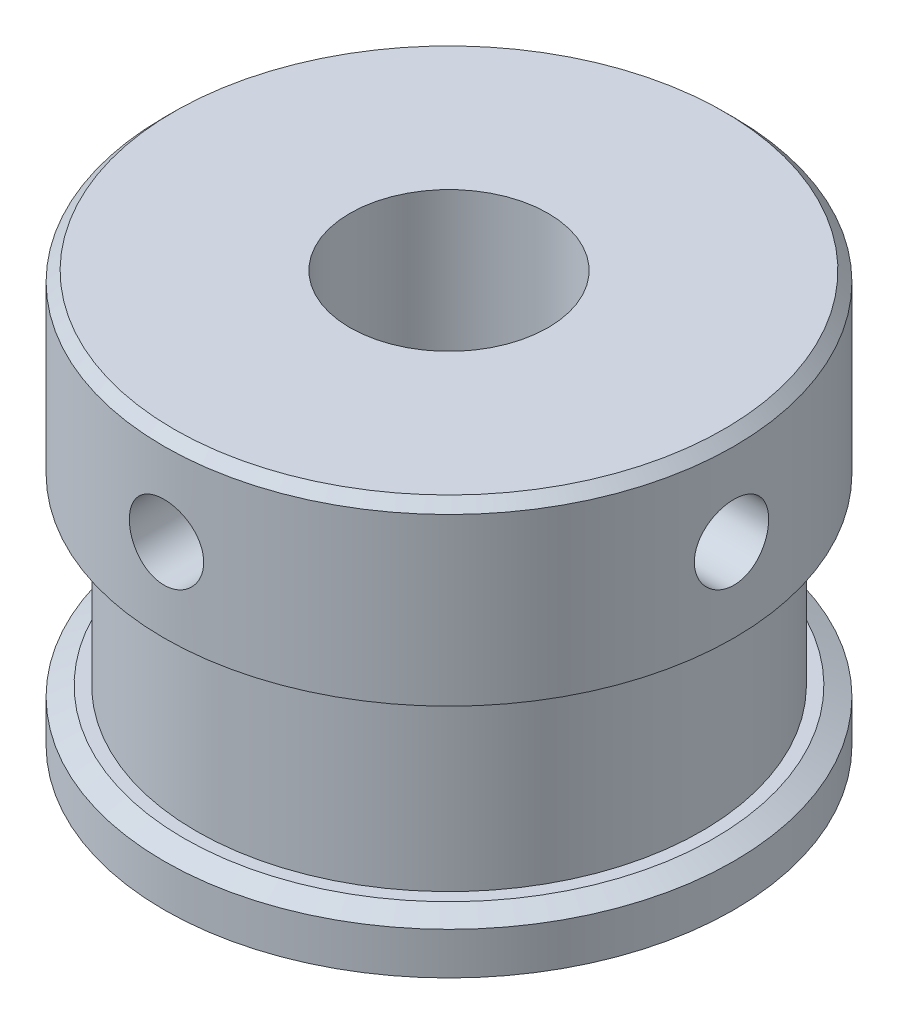
ISO-10303-21;
HEADER;
FILE_DESCRIPTION(('STEP AP214'),'2;1');
FILE_NAME('part.step','',(''),(''),'','','');
FILE_SCHEMA(('AUTOMOTIVE_DESIGN { 1 0 10303 214 1 1 1 1 }'));
ENDSEC;
DATA;
#1=APPLICATION_CONTEXT('core data for automotive mechanical design processes');
#2=APPLICATION_PROTOCOL_DEFINITION('international standard','automotive_design',2000,#1);
#3=PRODUCT_CONTEXT('',#1,'mechanical');
#4=PRODUCT('Part','Part','',(#3));
#5=PRODUCT_RELATED_PRODUCT_CATEGORY('part','',(#4));
#6=PRODUCT_DEFINITION_FORMATION('','',#4);
#7=PRODUCT_DEFINITION_CONTEXT('part definition',#1,'design');
#8=PRODUCT_DEFINITION('design','',#6,#7);
#9=PRODUCT_DEFINITION_SHAPE('','',#8);
#10=(LENGTH_UNIT() NAMED_UNIT(*) SI_UNIT(.MILLI.,.METRE.));
#11=(NAMED_UNIT(*) PLANE_ANGLE_UNIT() SI_UNIT($,.RADIAN.));
#12=(NAMED_UNIT(*) SI_UNIT($,.STERADIAN.) SOLID_ANGLE_UNIT());
#13=UNCERTAINTY_MEASURE_WITH_UNIT(LENGTH_MEASURE(1.E-05),#10,'distance_accuracy_value','');
#14=(GEOMETRIC_REPRESENTATION_CONTEXT(3) GLOBAL_UNCERTAINTY_ASSIGNED_CONTEXT((#13)) GLOBAL_UNIT_ASSIGNED_CONTEXT((#10,
#11,#12)) REPRESENTATION_CONTEXT('',''));
#15=CARTESIAN_POINT('',(0.,0.,0.));
#16=DIRECTION('',(0.,0.,1.));
#17=DIRECTION('',(1.,0.,0.));
#18=AXIS2_PLACEMENT_3D('',#15,#16,#17);
#19=CARTESIAN_POINT('',(0.,-3.15877434078088,0.));
#20=DIRECTION('',(0.,1.,0.));
#21=DIRECTION('',(0.,0.,1.));
#22=AXIS2_PLACEMENT_3D('',#19,#20,#21);
#23=CYLINDRICAL_SURFACE('',#22,4.);
#24=CARTESIAN_POINT('',(0.,3.25,3.99999999999995));
#25=CARTESIAN_POINT('',(0.081235058937846,3.24999709769688,4.00000217456146));
#26=CARTESIAN_POINT('',(0.162450241781781,3.25661976024837,3.99750379283182));
#27=CARTESIAN_POINT('',(0.322453452352335,3.28282819526992,3.9877869600693));
#28=CARTESIAN_POINT('',(0.401241827987579,3.30241210047058,3.98056918893997));
#29=CARTESIAN_POINT('',(0.554060784990846,3.35375300177175,3.96218832391547));
#30=CARTESIAN_POINT('',(0.628100224162258,3.38548651682176,3.95103284349439));
#31=CARTESIAN_POINT('',(0.769799310160252,3.46010641301579,3.92588767765355));
#32=CARTESIAN_POINT('',(0.837457239177884,3.50299578554415,3.91189723227555));
#33=CARTESIAN_POINT('',(0.967346417045847,3.60061253107091,3.88186246971226));
#34=CARTESIAN_POINT('',(1.02927073015123,3.65573026225939,3.8657600258357));
#35=CARTESIAN_POINT('',(1.14324421474367,3.77541043465882,3.8336022087132));
#36=CARTESIAN_POINT('',(1.19529036359205,3.83997575608786,3.81754685135021));
#37=CARTESIAN_POINT('',(1.28998202215988,3.9797174675232,3.7866247061772));
#38=CARTESIAN_POINT('',(1.33219393195764,4.05520436654581,3.77182648820814));
#39=CARTESIAN_POINT('',(1.40318646334089,4.21284835416851,3.74599860237434));
#40=CARTESIAN_POINT('',(1.43197244961243,4.29500276315509,3.73496742975881));
#41=CARTESIAN_POINT('',(1.47408431017553,4.46011674025819,3.71854412824134));
#42=CARTESIAN_POINT('',(1.48799593218563,4.54290503843544,3.71293924350836));
#43=CARTESIAN_POINT('',(1.50179556531653,4.70981615799384,3.70738061461212));
#44=CARTESIAN_POINT('',(1.50168936802634,4.79393841387447,3.70742453659301));
#45=CARTESIAN_POINT('',(1.48790429610022,4.95576952521296,3.71297511632051));
#46=CARTESIAN_POINT('',(1.47503808509008,5.03356090604418,3.7181546887112));
#47=CARTESIAN_POINT('',(1.43744167868336,5.18578715040532,3.73284938059527));
#48=CARTESIAN_POINT('',(1.41270969663265,5.26022150661389,3.74236515298859));
#49=CARTESIAN_POINT('',(1.35163748571911,5.40527706772825,3.76485702190249));
#50=CARTESIAN_POINT('',(1.31508648737107,5.47579948612132,3.77789517988165));
#51=CARTESIAN_POINT('',(1.23156073762701,5.60994573759098,3.80594210139317));
#52=CARTESIAN_POINT('',(1.18458238728896,5.6735671775197,3.8209515445715));
#53=CARTESIAN_POINT('',(1.07781780766547,5.79660366365088,3.85248038859105));
#54=CARTESIAN_POINT('',(1.01738298716957,5.85544864074811,3.86903347455669));
#55=CARTESIAN_POINT('',(0.887312590819074,5.96233796620582,3.90091728164086));
#56=CARTESIAN_POINT('',(0.817675603497414,6.01038065460569,3.91624781465948));
#57=CARTESIAN_POINT('',(0.66972343699248,6.09493039706252,3.94426394809077));
#58=CARTESIAN_POINT('',(0.591290713844793,6.13124758122106,3.95690498259618));
#59=CARTESIAN_POINT('',(0.428836850524664,6.18998260427004,3.97778718326958));
#60=CARTESIAN_POINT('',(0.344818210845841,6.21240661656112,3.98603030341476));
#61=CARTESIAN_POINT('',(0.178375243148726,6.24162278754195,3.99684443228049));
#62=CARTESIAN_POINT('',(0.0961036195622618,6.24918260638251,3.99969369025683));
#63=CARTESIAN_POINT('',(-0.0685724752549926,6.25069106389993,4.00025893700129));
#64=CARTESIAN_POINT('',(-0.150976912983354,6.24464272031679,3.99797606386863));
#65=CARTESIAN_POINT('',(-0.310262048561854,6.21968995769133,3.9887170977264));
#66=CARTESIAN_POINT('',(-0.387233328007332,6.2012884562629,3.98192470962303));
#67=CARTESIAN_POINT('',(-0.536941754957239,6.15281392745266,3.96451477091718));
#68=CARTESIAN_POINT('',(-0.609678350347572,6.12273938205196,3.95389672282033));
#69=CARTESIAN_POINT('',(-0.751247765110187,6.05081358756051,3.92949624407684));
#70=CARTESIAN_POINT('',(-0.819903083557801,6.00864227077657,3.91563000209349));
#71=CARTESIAN_POINT('',(-0.949392711726628,5.91408189682841,3.88626671564663));
#72=CARTESIAN_POINT('',(-1.01022412027048,5.86168906745485,3.87076907009515));
#73=CARTESIAN_POINT('',(-1.12603079874455,5.74459587787574,3.8387332949099));
#74=CARTESIAN_POINT('',(-1.18046154123566,5.67935781722729,3.82218696503731));
#75=CARTESIAN_POINT('',(-1.27771050031898,5.54034861529233,3.79078815746855));
#76=CARTESIAN_POINT('',(-1.32052767414514,5.4665767086115,3.77593583194399));
#77=CARTESIAN_POINT('',(-1.39337773518993,5.31198401322769,3.74966829822463));
#78=CARTESIAN_POINT('',(-1.42335685446911,5.23113525408955,3.73826760328496));
#79=CARTESIAN_POINT('',(-1.46907883466886,5.06499023631216,3.72054032891006));
#80=CARTESIAN_POINT('',(-1.48483050305538,4.97969676380186,3.71421061057487));
#81=CARTESIAN_POINT('',(-1.50086347097841,4.81298384045888,3.70775894792571));
#82=CARTESIAN_POINT('',(-1.50207331495834,4.73166736828311,3.70726444523344));
#83=CARTESIAN_POINT('',(-1.49136715641585,4.57005468372384,3.71158412745293));
#84=CARTESIAN_POINT('',(-1.47945239850118,4.48975837532842,3.71639780898892));
#85=CARTESIAN_POINT('',(-1.44355815630237,4.33495277328345,3.73048141585425));
#86=CARTESIAN_POINT('',(-1.41995798316518,4.26034165375467,3.73961085376662));
#87=CARTESIAN_POINT('',(-1.36169696779914,4.11609449150559,3.76121548297849));
#88=CARTESIAN_POINT('',(-1.32703332944941,4.04645971192985,3.77369151995217));
#89=CARTESIAN_POINT('',(-1.2455207593815,3.91017321030237,3.80139723903967));
#90=CARTESIAN_POINT('',(-1.19812832803005,3.84386920320011,3.81673698440968));
#91=CARTESIAN_POINT('',(-1.09334485729902,3.71985843902881,3.84806246757176));
#92=CARTESIAN_POINT('',(-1.03595064012807,3.66215442521323,3.86404840943137));
#93=CARTESIAN_POINT('',(-0.909080396784617,3.55379804417815,3.89590424609873));
#94=CARTESIAN_POINT('',(-0.839118644212971,3.50369624656535,3.91172104900642));
#95=CARTESIAN_POINT('',(-0.691213223200799,3.41597734472347,3.94054514457034));
#96=CARTESIAN_POINT('',(-0.613268934090615,3.37836121226362,3.95355221851562));
#97=CARTESIAN_POINT('',(-0.447999082002315,3.31562317095166,3.97574292606682));
#98=CARTESIAN_POINT('',(-0.360413422234205,3.29111293539811,3.98473657158358));
#99=CARTESIAN_POINT('',(-0.181875733606377,3.25830704007934,3.99686242179585));
#100=CARTESIAN_POINT('',(-0.0909254163648577,3.25000324851269,3.99999756603962));
#101=CARTESIAN_POINT('',(0.,3.25,3.99999999999995));
#102=B_SPLINE_CURVE_WITH_KNOTS('',3,(#24,#25,#26,#27,#28,#29,#30,#31,#32,#33,#34,#35,#36,#37,
#38,#39,#40,#41,#42,#43,#44,#45,#46,#47,#48,#49,#50,#51,#52,#53,#54,#55,#56,#57,#58,#59,#60,#61,
#62,#63,#64,#65,#66,#67,#68,#69,#70,#71,#72,#73,#74,#75,#76,#77,#78,#79,#80,#81,#82,#83,#84,#85,
#86,#87,#88,#89,#90,#91,#92,#93,#94,#95,#96,#97,#98,#99,#100,#101),.UNSPECIFIED.,.T.,.F.,(4,2,2,
2,2,2,2,2,2,2,2,2,2,2,2,2,2,2,2,2,2,2,2,2,2,2,2,2,2,2,2,2,2,2,2,2,2,2,4),(0.,0.243369801560539,
0.486704549530416,0.729571369213549,0.972503379609487,1.22473618582718,1.47704604925626,
1.73896674501662,2.00078269352137,2.25185874416906,2.50283106079712,2.73878345119976,
2.97477138060593,3.21522408387024,3.45575990744267,3.7124615333582,3.9692025790507,
4.22991375286077,4.49050899698847,4.73725019635931,4.98393668390529,5.2211443792385,
5.45838293254466,5.70259221859611,5.94689180019878,6.20536519455665,6.46386178920146,
6.72343066727211,6.98283874956515,7.22558763480259,7.46831350211265,7.7036314242654,
7.93900886656514,8.18672471884276,8.43451941997065,8.69572329654043,8.95694749805106,
9.22948515032046,9.5018860179613),.UNSPECIFIED.);
#103=CARTESIAN_POINT('',(0.,3.25,3.99999999999995));
#104=VERTEX_POINT('',#103);
#105=EDGE_CURVE('E68',#104,#104,#102,.T.);
#106=ORIENTED_EDGE('',*,*,#105,.T.);
#107=EDGE_LOOP('',(#106));
#108=FACE_BOUND('',#107,.T.);
#109=CARTESIAN_POINT('',(0.,8.50000000000001,0.));
#110=DIRECTION('',(0.,1.,0.));
#111=DIRECTION('',(0.,0.,1.));
#112=AXIS2_PLACEMENT_3D('',#109,#110,#111);
#113=CIRCLE('',#112,4.);
#114=CARTESIAN_POINT('',(0.,8.50000000000001,4.));
#115=VERTEX_POINT('',#114);
#116=EDGE_CURVE('E146',#115,#115,#113,.T.);
#117=ORIENTED_EDGE('',*,*,#116,.T.);
#118=EDGE_LOOP('',(#117));
#119=FACE_BOUND('',#118,.T.);
#120=CARTESIAN_POINT('',(0.,-8.50000000000001,0.));
#121=DIRECTION('',(0.,1.,0.));
#122=DIRECTION('',(0.,0.,1.));
#123=AXIS2_PLACEMENT_3D('',#120,#121,#122);
#124=CIRCLE('',#123,4.);
#125=CARTESIAN_POINT('',(0.,-8.50000000000001,4.));
#126=VERTEX_POINT('',#125);
#127=EDGE_CURVE('E149',#126,#126,#124,.T.);
#128=ORIENTED_EDGE('',*,*,#127,.F.);
#129=EDGE_LOOP('',(#128));
#130=FACE_BOUND('',#129,.T.);
#131=CARTESIAN_POINT('',(3.70809924354781,4.75,-1.50000000000006));
#132=CARTESIAN_POINT('',(3.70809640633804,4.8310074837208,-1.50000304106115));
#133=CARTESIAN_POINT('',(3.71078260240982,4.91199492250365,-1.49341597549494));
#134=CARTESIAN_POINT('',(3.72116159304967,5.0715280829132,-1.46736187895472));
#135=CARTESIAN_POINT('',(3.72885423767118,5.15007387759499,-1.44789523373263));
#136=CARTESIAN_POINT('',(3.74825480280906,5.30237537161352,-1.39689657610573));
#137=CARTESIAN_POINT('',(3.7599530956926,5.37614205665111,-1.36539347266352));
#138=CARTESIAN_POINT('',(3.78603134206595,5.51737189681887,-1.29131856742703));
#139=CARTESIAN_POINT('',(3.80041210067322,5.58483315028252,-1.24874344095041));
#140=CARTESIAN_POINT('',(3.83103574665713,5.71489031162281,-1.15146661374164));
#141=CARTESIAN_POINT('',(3.84733341923602,5.77712852962941,-1.0963038121331));
#142=CARTESIAN_POINT('',(3.87949750628546,5.8917228146715,-0.976395839778976));
#143=CARTESIAN_POINT('',(3.89536382814787,5.94407677374185,-0.911648630256719));
#144=CARTESIAN_POINT('',(3.92552873936557,6.0391395122956,-0.771694655177635));
#145=CARTESIAN_POINT('',(3.93975561223508,6.08145947471586,-0.696206947538071));
#146=CARTESIAN_POINT('',(3.96438007973844,6.15265117252493,-0.538555771965293));
#147=CARTESIAN_POINT('',(3.97477900216999,6.18152757199199,-0.456394630933576));
#148=CARTESIAN_POINT('',(3.99018697103433,6.22375789577463,-0.291489341676866));
#149=CARTESIAN_POINT('',(3.99540915214772,6.23772762744046,-0.208923197281629));
#150=CARTESIAN_POINT('',(4.00064014107942,6.25172120094499,-0.0424643637948101));
#151=CARTESIAN_POINT('',(4.00065064414904,6.25174957761871,0.0414278850628154));
#152=CARTESIAN_POINT('',(3.99559265903895,6.23821823853482,0.203743543064466));
#153=CARTESIAN_POINT('',(3.99077541996683,6.22533070205117,0.282232178266892));
#154=CARTESIAN_POINT('',(3.97693274932262,6.18746408477444,0.435839217984403));
#155=CARTESIAN_POINT('',(3.96790701975577,6.16248414773798,0.510957383430328));
#156=CARTESIAN_POINT('',(3.9463776916753,6.10082954832416,0.656989017303131));
#157=CARTESIAN_POINT('',(3.93382539470077,6.06398999473155,0.727825392287315));
#158=CARTESIAN_POINT('',(3.90651310225278,5.97980790307058,0.862486607957574));
#159=CARTESIAN_POINT('',(3.89175239512838,5.93246197698241,0.926309176932366));
#160=CARTESIAN_POINT('',(3.86052529655814,5.82537271371684,1.04909048680097));
#161=CARTESIAN_POINT('',(3.84400963763883,5.76506608434956,1.10754614526347));
#162=CARTESIAN_POINT('',(3.81182460645724,5.63540700667841,1.21370395569337));
#163=CARTESIAN_POINT('',(3.79615544748848,5.56605229341335,1.26140340692894));
#164=CARTESIAN_POINT('',(3.76712703500335,5.41828053253717,1.34565611808146));
#165=CARTESIAN_POINT('',(3.75382677150278,5.33969650631392,1.38193847851824));
#166=CARTESIAN_POINT('',(3.73172438629005,5.17690377483242,1.44056464441497));
#167=CARTESIAN_POINT('',(3.72291976205787,5.09269822840631,1.46291620605594));
#168=CARTESIAN_POINT('',(3.71139597222853,4.92602403768405,1.49190191709666));
#169=CARTESIAN_POINT('',(3.7083678524154,4.84371589446387,1.4993352115896));
#170=CARTESIAN_POINT('',(3.70786539525017,4.67899064325826,1.50057885636267));
#171=CARTESIAN_POINT('',(3.71038967003986,4.59657356764753,1.49439261093762));
#172=CARTESIAN_POINT('',(3.72039381629735,4.43807007771233,1.46929733520157));
#173=CARTESIAN_POINT('',(3.72763276216451,4.36186886423538,1.45100618334219));
#174=CARTESIAN_POINT('',(3.74596487046363,4.21365205527983,1.40299774640634));
#175=CARTESIAN_POINT('',(3.75705882250172,4.14163732083186,1.37327812034626));
#176=CARTESIAN_POINT('',(3.7823624311608,4.0008355619238,1.30200292275282));
#177=CARTESIAN_POINT('',(3.79667328892068,3.93227070786271,1.26004545177045));
#178=CARTESIAN_POINT('',(3.8266281429429,3.802871018274,1.16591317862475));
#179=CARTESIAN_POINT('',(3.8422726259407,3.74203902537537,1.11373463696434));
#180=CARTESIAN_POINT('',(3.87433046553175,3.62583162680488,0.996727340900945));
#181=CARTESIAN_POINT('',(3.89072969357024,3.57104659123125,0.931306341491033));
#182=CARTESIAN_POINT('',(3.92149874963308,3.47316163241058,0.791797471753086));
#183=CARTESIAN_POINT('',(3.93586857107675,3.43006174705417,0.717709573322608));
#184=CARTESIAN_POINT('',(3.96094985704561,3.35705394380039,0.563016329468408));
#185=CARTESIAN_POINT('',(3.97167381338012,3.3271008762074,0.482434433064558));
#186=CARTESIAN_POINT('',(3.9882943671257,3.28134358615008,0.3168818875232));
#187=CARTESIAN_POINT('',(3.99419323299415,3.2655327145776,0.231913320723552));
#188=CARTESIAN_POINT('',(4.00028407317076,3.24922559724517,0.0653355852737941));
#189=CARTESIAN_POINT('',(4.00078860953765,3.247890516941,-0.0161807680608607));
#190=CARTESIAN_POINT('',(3.99684889809223,3.2584151594454,-0.178226786412423));
#191=CARTESIAN_POINT('',(3.99240524713131,3.27027329088588,-0.258756569245246));
#192=CARTESIAN_POINT('',(3.97921089603773,3.30625885149363,-0.414548248377117));
#193=CARTESIAN_POINT('',(3.97056791378018,3.33007990587834,-0.489890731068837));
#194=CARTESIAN_POINT('',(3.94987783620989,3.38901001338434,-0.63551547300639));
#195=CARTESIAN_POINT('',(3.93783009655661,3.42412120330476,-0.70579677127553));
#196=CARTESIAN_POINT('',(3.91090618300071,3.5063139435048,-0.842540176994407));
#197=CARTESIAN_POINT('',(3.89593240108828,3.55383664051411,-0.908717548846866));
#198=CARTESIAN_POINT('',(3.86499507694845,3.65880783018757,-1.03241734752336));
#199=CARTESIAN_POINT('',(3.84903118274027,3.71625986580787,-1.08993667125585));
#200=CARTESIAN_POINT('',(3.81688129739174,3.84306413164506,-1.19781214236192));
#201=CARTESIAN_POINT('',(3.80072805349159,3.91288440215428,-1.24762999816027));
#202=CARTESIAN_POINT('',(3.77098325003637,4.06041586957329,-1.33484709556848));
#203=CARTESIAN_POINT('',(3.75739195631214,4.13812788405347,-1.37224504878159));
#204=CARTESIAN_POINT('',(3.73402269853263,4.30295568097541,-1.43465886974262));
#205=CARTESIAN_POINT('',(3.72443803290857,4.39033436651178,-1.45906002899527));
#206=CARTESIAN_POINT('',(3.71147994336314,4.56848527195578,-1.49172356722085));
#207=CARTESIAN_POINT('',(3.70810242179735,4.65925521270999,-1.49999659339576));
#208=CARTESIAN_POINT('',(3.70809924354781,4.75,-1.50000000000006));
#209=B_SPLINE_CURVE_WITH_KNOTS('',3,(#131,#132,#133,#134,#135,#136,#137,#138,#139,#140,#141,
#142,#143,#144,#145,#146,#147,#148,#149,#150,#151,#152,#153,#154,#155,#156,#157,#158,#159,#160,
#161,#162,#163,#164,#165,#166,#167,#168,#169,#170,#171,#172,#173,#174,#175,#176,#177,#178,#179,
#180,#181,#182,#183,#184,#185,#186,#187,#188,#189,#190,#191,#192,#193,#194,#195,#196,#197,#198,
#199,#200,#201,#202,#203,#204,#205,#206,#207,#208),.UNSPECIFIED.,.T.,.F.,(4,2,2,2,2,2,2,2,2,2,2,
2,2,2,2,2,2,2,2,2,2,2,2,2,2,2,2,2,2,2,2,2,2,2,2,2,2,2,4),(0.,0.242684541416169,
0.485361814598863,0.72745985675704,0.969630679682935,1.22274652401127,1.47591628822982,
1.7377007213642,1.99939426381329,2.24980018489679,2.50012465404859,2.73806472803198,
2.97602165263341,3.21744131210674,3.45893893628982,3.71456675065877,3.97025867827335,
4.23162592252967,4.49284751635475,4.73965657740485,4.98640395388883,5.22143845928197,
5.45652113429523,5.70041561005818,5.94439948466352,6.20385016993625,6.46330169650184,
6.72185508890172,6.98028685560127,7.22365720549934,7.46699820319476,7.70440274003887,
7.94185223512828,8.18928323676982,8.43680270894959,8.69738599542076,8.95799630544242,
9.23003178870926,9.50188762323054),.UNSPECIFIED.);
#210=CARTESIAN_POINT('',(3.70809924354781,4.75,-1.50000000000006));
#211=VERTEX_POINT('',#210);
#212=EDGE_CURVE('E77',#211,#211,#209,.T.);
#213=ORIENTED_EDGE('',*,*,#212,.T.);
#214=EDGE_LOOP('',(#213));
#215=FACE_BOUND('',#214,.T.);
#216=ADVANCED_FACE('F17',(#108,#119,#130,#215),#23,.F.);
#217=CARTESIAN_POINT('',(0.,-3.15877434078088,0.));
#218=DIRECTION('',(0.,1.,0.));
#219=DIRECTION('',(0.,0.,1.));
#220=AXIS2_PLACEMENT_3D('',#217,#218,#219);
#221=CYLINDRICAL_SURFACE('',#220,11.5);
#222=CARTESIAN_POINT('',(0.,8.1,0.));
#223=DIRECTION('',(0.,1.,0.));
#224=DIRECTION('',(0.,0.,1.));
#225=AXIS2_PLACEMENT_3D('',#222,#223,#224);
#226=CIRCLE('',#225,11.5);
#227=CARTESIAN_POINT('',(0.,8.1,11.5));
#228=VERTEX_POINT('',#227);
#229=EDGE_CURVE('E38',#228,#228,#226,.F.);
#230=ORIENTED_EDGE('',*,*,#229,.T.);
#231=EDGE_LOOP('',(#230));
#232=FACE_BOUND('',#231,.T.);
#233=CARTESIAN_POINT('',(0.,1.40000000000001,0.));
#234=DIRECTION('',(0.,-1.,0.));
#235=DIRECTION('',(0.,0.,-1.));
#236=AXIS2_PLACEMENT_3D('',#233,#234,#235);
#237=CIRCLE('',#236,11.5);
#238=CARTESIAN_POINT('',(0.,1.40000000000001,-11.5));
#239=VERTEX_POINT('',#238);
#240=EDGE_CURVE('E156',#239,#239,#237,.F.);
#241=ORIENTED_EDGE('',*,*,#240,.T.);
#242=EDGE_LOOP('',(#241));
#243=FACE_BOUND('',#242,.T.);
#244=CARTESIAN_POINT('',(0.,3.25,11.4999999999999));
#245=CARTESIAN_POINT('',(-0.08387367547568,3.25000354399216,11.4999987889705));
#246=CARTESIAN_POINT('',(-0.16779900786446,3.25705851900221,11.4990727424737));
#247=CARTESIAN_POINT('',(-0.33331219705856,3.28508962832947,11.4954676443032));
#248=CARTESIAN_POINT('',(-0.414897556062015,3.30608010041326,11.4927867872035));
#249=CARTESIAN_POINT('',(-0.573310862574349,3.36135143122372,11.4859739305167));
#250=CARTESIAN_POINT('',(-0.650142050157395,3.39562312019121,11.4818429323363));
#251=CARTESIAN_POINT('',(-0.796948541825167,3.47646348354351,11.4725886401554));
#252=CARTESIAN_POINT('',(-0.866924973730797,3.52303013034988,11.4674655098059));
#253=CARTESIAN_POINT('',(-0.99846758428207,3.6274357031806,11.4567642658025));
#254=CARTESIAN_POINT('',(-1.05998690599804,3.68533343735684,11.4511838707794));
#255=CARTESIAN_POINT('',(-1.1724652872007,3.81063133213307,11.4402153265713));
#256=CARTESIAN_POINT('',(-1.22342379516471,3.87803198870025,11.4348271874387));
#257=CARTESIAN_POINT('',(-1.31351024770354,4.02072919284479,11.4248308534604));
#258=CARTESIAN_POINT('',(-1.3525939860959,4.09605387217164,11.4202256004087));
#259=CARTESIAN_POINT('',(-1.41753910895751,4.25226794545656,11.4123468049196));
#260=CARTESIAN_POINT('',(-1.44340103860289,4.33315710981761,11.4090732075751));
#261=CARTESIAN_POINT('',(-1.48102535604964,4.49771622469038,11.4042503168757));
#262=CARTESIAN_POINT('',(-1.49286711031839,4.58136773971688,11.4026913209814));
#263=CARTESIAN_POINT('',(-1.50236057802508,4.74948411506376,11.4014445124782));
#264=CARTESIAN_POINT('',(-1.50001291115999,4.83394893970348,11.4017566181523));
#265=CARTESIAN_POINT('',(-1.48125926874543,5.00073965657812,11.4042078698221));
#266=CARTESIAN_POINT('',(-1.46494091291049,5.08307559181957,11.4063356283479));
#267=CARTESIAN_POINT('',(-1.41884591021781,5.24383042386289,11.4121606755201));
#268=CARTESIAN_POINT('',(-1.38906896860542,5.32224923483458,11.4158579985412));
#269=CARTESIAN_POINT('',(-1.31680849453618,5.47321485926694,11.4244184254902));
#270=CARTESIAN_POINT('',(-1.27428708175244,5.5457433365129,11.4292849960909));
#271=CARTESIAN_POINT('',(-1.17777176527455,5.68266848096278,11.4396329366713));
#272=CARTESIAN_POINT('',(-1.12377729049829,5.74706474312381,11.4451143372484));
#273=CARTESIAN_POINT('',(-1.00536389947357,5.86640590602695,11.4561248839528));
#274=CARTESIAN_POINT('',(-0.940869497437052,5.92127593108799,11.4616540786179));
#275=CARTESIAN_POINT('',(-0.803546382709047,6.01942340252411,11.4720986286902));
#276=CARTESIAN_POINT('',(-0.730717647775637,6.06270081796084,11.4770139824593));
#277=CARTESIAN_POINT('',(-0.578734018158932,6.13643540224874,11.485680465931));
#278=CARTESIAN_POINT('',(-0.499576715280729,6.16688766288078,11.4894311497676));
#279=CARTESIAN_POINT('',(-0.337212307082038,6.214046930639,11.4953417256299));
#280=CARTESIAN_POINT('',(-0.254005408543423,6.23075463881603,11.4975016987902));
#281=CARTESIAN_POINT('',(-0.0865509170951626,6.24985297755591,11.4999768972912));
#282=CARTESIAN_POINT('',(-0.00231527186087731,6.2523467107699,11.5003054069739));
#283=CARTESIAN_POINT('',(0.165372777140066,6.24321871999352,11.4991165911979));
#284=CARTESIAN_POINT('',(0.24882519905947,6.23159732396733,11.4975993086261));
#285=CARTESIAN_POINT('',(0.41227203547529,6.19465463600026,11.492897652094));
#286=CARTESIAN_POINT('',(0.49227779807655,6.16938272179503,11.4897192880655));
#287=CARTESIAN_POINT('',(0.64691586058682,6.10590785904704,11.48205116634));
#288=CARTESIAN_POINT('',(0.721547963291835,6.06770443623338,11.4775613605459));
#289=CARTESIAN_POINT('',(0.863779209036563,5.97920309552064,11.4677374606315));
#290=CARTESIAN_POINT('',(0.931336693285117,5.92883874473719,11.4623987859822));
#291=CARTESIAN_POINT('',(1.05707662855495,5.81753888637903,11.4514881052812));
#292=CARTESIAN_POINT('',(1.11525867281435,5.75660292038336,11.445916089119));
#293=CARTESIAN_POINT('',(1.22096386356528,5.6254344134895,11.435125505803));
#294=CARTESIAN_POINT('',(1.26841850564589,5.55514643909561,11.4299093510067));
#295=CARTESIAN_POINT('',(1.35084798726365,5.4075370670475,11.4204613909882));
#296=CARTESIAN_POINT('',(1.38582309548539,5.33021582086473,11.4162295645741));
#297=CARTESIAN_POINT('',(1.44219073788253,5.1709524053382,11.4092460653583));
#298=CARTESIAN_POINT('',(1.46362137263966,5.0890239105499,11.4064902439233));
#299=CARTESIAN_POINT('',(1.4924141614814,4.92269273085985,11.4027590627917));
#300=CARTESIAN_POINT('',(1.49977703312957,4.83829017237725,11.4017836122825));
#301=CARTESIAN_POINT('',(1.50021133318704,4.67008850104972,11.4017264204223));
#302=CARTESIAN_POINT('',(1.49339039767644,4.58628965071035,11.4026304165807));
#303=CARTESIAN_POINT('',(1.46587918768885,4.42104056014687,11.4061995300276));
#304=CARTESIAN_POINT('',(1.44518891595677,4.33959031945794,11.4088646469677));
#305=CARTESIAN_POINT('',(1.39056092558017,4.18136788518609,11.4156511823152));
#306=CARTESIAN_POINT('',(1.35662887172568,4.10459370741385,11.4197719779168));
#307=CARTESIAN_POINT('',(1.2764911013054,3.95781135393135,11.4290065281123));
#308=CARTESIAN_POINT('',(1.23028517717279,3.88780329267208,11.4341202994983));
#309=CARTESIAN_POINT('',(1.12651352497628,3.75599083285157,11.444811054693));
#310=CARTESIAN_POINT('',(1.06886765466833,3.69424977382769,11.4503911357269));
#311=CARTESIAN_POINT('',(0.944020432211569,3.58127690655438,11.4613587220616));
#312=CARTESIAN_POINT('',(0.876816837734342,3.5300475713594,11.4667461817993));
#313=CARTESIAN_POINT('',(0.734440983208721,3.43936981300331,11.4767463223463));
#314=CARTESIAN_POINT('',(0.659236923265528,3.39997097741546,11.4813557074918));
#315=CARTESIAN_POINT('',(0.503260285581684,3.33441873478555,11.4892472513977));
#316=CARTESIAN_POINT('',(0.422493808644726,3.30825107073331,11.4925308379762));
#317=CARTESIAN_POINT('',(0.28443348518241,3.27610206984066,11.4966176944656));
#318=CARTESIAN_POINT('',(0.228006817894454,3.26632803844138,11.4978798128957));
#319=CARTESIAN_POINT('',(0.114394773946369,3.25327582179696,11.4995713752256));
#320=CARTESIAN_POINT('',(0.0572094035826113,3.24999758267804,11.5000008260311));
#321=CARTESIAN_POINT('',(0.,3.25,11.4999999999999));
#322=B_SPLINE_CURVE_WITH_KNOTS('',3,(#244,#245,#246,#247,#248,#249,#250,#251,#252,#253,#254,
#255,#256,#257,#258,#259,#260,#261,#262,#263,#264,#265,#266,#267,#268,#269,#270,#271,#272,#273,
#274,#275,#276,#277,#278,#279,#280,#281,#282,#283,#284,#285,#286,#287,#288,#289,#290,#291,#292,
#293,#294,#295,#296,#297,#298,#299,#300,#301,#302,#303,#304,#305,#306,#307,#308,#309,#310,#311,
#312,#313,#314,#315,#316,#317,#318,#319,#320,#321),.UNSPECIFIED.,.T.,.F.,(4,2,2,2,2,2,2,2,2,2,2,
2,2,2,2,2,2,2,2,2,2,2,2,2,2,2,2,2,2,2,2,2,2,2,2,2,2,2,4),(0.,0.251412042547973,
0.503083156235488,0.754580817165497,1.00603702914679,1.25883466510266,1.51164549971169,
1.76538625583096,2.01911654858883,2.27140353166937,2.52367949665773,2.77438476136931,
3.02509551700846,3.27655897620068,3.5280349551488,3.78140588995846,4.03477750095762,
4.28824598999318,4.5417015498833,4.79331627883386,5.04492516164317,5.29562994105653,
5.54634391621596,5.79845977877208,6.05058657665799,6.30428060859517,6.55796917816599,
6.81094090821314,7.06389973442208,7.31494594958275,7.56599211505818,7.81693100134909,
8.0678741316072,8.32064158523565,8.57346843851722,8.82734068052484,9.08093878097975,
9.25242586815105,9.42391153306391),.UNSPECIFIED.);
#323=CARTESIAN_POINT('',(0.,3.25,11.4999999999999));
#324=VERTEX_POINT('',#323);
#325=EDGE_CURVE('E30',#324,#324,#322,.T.);
#326=ORIENTED_EDGE('',*,*,#325,.T.);
#327=EDGE_LOOP('',(#326));
#328=FACE_BOUND('',#327,.T.);
#329=CARTESIAN_POINT('',(11.4017542509914,4.75,-1.50000000000006));
#330=CARTESIAN_POINT('',(11.4017555010927,4.66612974605352,-1.49999645301455));
#331=CARTESIAN_POINT('',(11.4026896606142,4.58220782531928,-1.49294203416227));
#332=CARTESIAN_POINT('',(11.4063237260242,4.41670172381517,-1.46491333453703));
#333=CARTESIAN_POINT('',(11.4090254521656,4.33512004354481,-1.44392470388231));
#334=CARTESIAN_POINT('',(11.4158835494573,4.17671451862599,-1.38865875899913));
#335=CARTESIAN_POINT('',(11.4200389070908,4.09988740275981,-1.35439070180734));
#336=CARTESIAN_POINT('',(11.4293348464697,3.95308774393182,-1.27355889313984));
#337=CARTESIAN_POINT('',(11.4344752664174,3.88311407813168,-1.22699716043969));
#338=CARTESIAN_POINT('',(11.445197137233,3.75156838698373,-1.1225965695889));
#339=CARTESIAN_POINT('',(11.450780832969,3.69004408459843,-1.06469780379545));
#340=CARTESIAN_POINT('',(11.4617399588797,3.57755607833823,-0.939395748791601));
#341=CARTESIAN_POINT('',(11.4671153784681,3.52659291069306,-0.871991977267075));
#342=CARTESIAN_POINT('',(11.4770753814867,3.43650155148105,-0.729292001348455));
#343=CARTESIAN_POINT('',(11.4816570418954,3.3974167196513,-0.653968201092628));
#344=CARTESIAN_POINT('',(11.4894885821545,3.3324693333558,-0.497756037054366));
#345=CARTESIAN_POINT('',(11.4927385156426,3.30660624635004,-0.41686789753902));
#346=CARTESIAN_POINT('',(11.4975246059022,3.26897956068909,-0.252312093764315));
#347=CARTESIAN_POINT('',(11.4990704204953,3.25713647735638,-0.168662889559703));
#348=CARTESIAN_POINT('',(11.5003071067839,3.24763955068957,-0.000551051593681437));
#349=CARTESIAN_POINT('',(11.4999980575609,3.24998510242647,0.0839115473355527));
#350=CARTESIAN_POINT('',(11.4975676318305,3.26873536177966,0.250711499958782));
#351=CARTESIAN_POINT('',(11.495457275758,3.28505458012217,0.333058646852817));
#352=CARTESIAN_POINT('',(11.4896737037343,3.3311551807269,0.493835455554753));
#353=CARTESIAN_POINT('',(11.4860004558634,3.36093683793923,0.572265037315937));
#354=CARTESIAN_POINT('',(11.4774848372199,3.43320714577403,0.723243851165286));
#355=CARTESIAN_POINT('',(11.4726390893117,3.47573258809547,0.795775273641111));
#356=CARTESIAN_POINT('',(11.4623201935655,3.57225654245435,0.932704606534559));
#357=CARTESIAN_POINT('',(11.4568470144162,3.62625562718919,0.997102110698442));
#358=CARTESIAN_POINT('',(11.4458372756447,3.74467233134335,1.11643819513597));
#359=CARTESIAN_POINT('',(11.4403005474488,3.80916448462651,1.17130282662096));
#360=CARTESIAN_POINT('',(11.4298278324284,3.9464811631493,1.26944048103685));
#361=CARTESIAN_POINT('',(11.4248918478016,4.0193057188702,1.31271346156173));
#362=CARTESIAN_POINT('',(11.4161795912172,4.17128812702737,1.38644483776155));
#363=CARTESIAN_POINT('',(11.4124038861902,4.25044905177648,1.41689697165309));
#364=CARTESIAN_POINT('',(11.4064505206359,4.41282134575288,1.46405488015556));
#365=CARTESIAN_POINT('',(11.4042727759921,4.49603250153029,1.48076137834171));
#366=CARTESIAN_POINT('',(11.4017774109739,4.66348911375157,1.49985514370491));
#367=CARTESIAN_POINT('',(11.4014462521966,4.7477224923938,1.50234663257978));
#368=CARTESIAN_POINT('',(11.4026457215703,4.91540547241167,1.49321496203155));
#369=CARTESIAN_POINT('',(11.4041763064158,4.99885509197255,1.48159213091644));
#370=CARTESIAN_POINT('',(11.4089144348313,5.16228727005644,1.44464963434862));
#371=CARTESIAN_POINT('',(11.4121157621508,5.24228149832656,1.41938072914776));
#372=CARTESIAN_POINT('',(11.4198296111094,5.39689781992072,1.35591573806601));
#373=CARTESIAN_POINT('',(11.4243421826685,5.47151970858117,1.31771916001075));
#374=CARTESIAN_POINT('',(11.4342023912125,5.61374376689707,1.2292280211062));
#375=CARTESIAN_POINT('',(11.4395546717525,5.68130319523188,1.17886529183306));
#376=CARTESIAN_POINT('',(11.4504767766229,5.80704780596861,1.06756750174705));
#377=CARTESIAN_POINT('',(11.4560466101759,5.86523259042252,1.00663199235392));
#378=CARTESIAN_POINT('',(11.4668179794224,5.97094402888093,0.875462338341581));
#379=CARTESIAN_POINT('',(11.4720170065382,6.01840207901288,0.805172669271225));
#380=CARTESIAN_POINT('',(11.4814231748458,6.10083753540954,0.657558967858969));
#381=CARTESIAN_POINT('',(11.4856303375335,6.13581521216148,0.580235088015154));
#382=CARTESIAN_POINT('',(11.4925676402684,6.19218448448027,0.420973071168353));
#383=CARTESIAN_POINT('',(11.4953020399787,6.21361529312715,0.339049006517422));
#384=CARTESIAN_POINT('',(11.4990034533124,6.24240992971606,0.172727196515954));
#385=CARTESIAN_POINT('',(11.4999705540812,6.24977445126497,0.088329573344667));
#386=CARTESIAN_POINT('',(11.5000279000697,6.25021369871506,-0.0798746769517216));
#387=CARTESIAN_POINT('',(11.4991320170928,6.24339404014946,-0.163681043071324));
#388=CARTESIAN_POINT('',(11.49559170592,6.21588274606022,-0.328945491538674));
#389=CARTESIAN_POINT('',(11.4929472797203,6.19519112637327,-0.410403576567188));
#390=CARTESIAN_POINT('',(11.4862056490748,6.14055733378626,-0.568642219855355));
#391=CARTESIAN_POINT('',(11.4821090502512,6.10662068407238,-0.645424712431759));
#392=CARTESIAN_POINT('',(11.4729159452671,6.02647113767378,-0.79222178732868));
#393=CARTESIAN_POINT('',(11.4678194229654,5.9802580428133,-0.862236260369767));
#394=CARTESIAN_POINT('',(11.4571496362498,5.87647834381004,-0.99404872854614));
#395=CARTESIAN_POINT('',(11.4515732358813,5.8188332476528,-1.05578467493504));
#396=CARTESIAN_POINT('',(11.4405969587125,5.69398969875131,-1.168747587459));
#397=CARTESIAN_POINT('',(11.4351971239349,5.62678899182307,-1.21997206693612));
#398=CARTESIAN_POINT('',(11.4251611483061,5.48441564651668,-1.3106444109052));
#399=CARTESIAN_POINT('',(11.4205283132887,5.40921068337356,-1.35004186374937));
#400=CARTESIAN_POINT('',(11.4125895944072,5.25323216464592,-1.41559127347491));
#401=CARTESIAN_POINT('',(11.4092822814234,5.17246471702341,-1.44175750369105));
#402=CARTESIAN_POINT('',(11.4051643222105,5.03440820135863,-1.47390259785783));
#403=CARTESIAN_POINT('',(11.4038919959272,4.97798658642477,-1.4836748717358));
#404=CARTESIAN_POINT('',(11.4021865375875,4.86438465517099,-1.49672475464488));
#405=CARTESIAN_POINT('',(11.4017533983503,4.80720434534723,-1.50000241924853));
#406=CARTESIAN_POINT('',(11.4017542509914,4.75,-1.50000000000006));
#407=B_SPLINE_CURVE_WITH_KNOTS('',3,(#329,#330,#331,#332,#333,#334,#335,#336,#337,#338,#339,
#340,#341,#342,#343,#344,#345,#346,#347,#348,#349,#350,#351,#352,#353,#354,#355,#356,#357,#358,
#359,#360,#361,#362,#363,#364,#365,#366,#367,#368,#369,#370,#371,#372,#373,#374,#375,#376,#377,
#378,#379,#380,#381,#382,#383,#384,#385,#386,#387,#388,#389,#390,#391,#392,#393,#394,#395,#396,
#397,#398,#399,#400,#401,#402,#403,#404,#405,#406),.UNSPECIFIED.,.T.,.F.,(4,2,2,2,2,2,2,2,2,2,2,
2,2,2,2,2,2,2,2,2,2,2,2,2,2,2,2,2,2,2,2,2,2,2,2,2,2,2,4),(0.,0.251401763409768,
0.503062830563611,0.754548780434053,1.00599345881713,1.25880454908435,1.51162847240701,
1.76536449581034,2.01909029853272,2.27137063822617,2.52364022208437,2.77437738752203,
3.02511967412113,3.27659295200129,3.52807878491239,3.78143590806989,4.03479395807764,
4.28827560662903,4.54174391096107,4.79335142269097,5.04495308198347,5.29562522352576,
5.54630690957678,5.79842717499935,6.05055813995757,6.30425867142354,6.55795370410214,
6.81091098132409,7.06385578493153,7.31492390374275,7.56599173592654,7.81695498432961,
8.06792228421943,8.32067641903956,8.57349027819169,8.82736691371988,9.08096908946929,
9.2524410437841,9.42391153085535),.UNSPECIFIED.);
#408=CARTESIAN_POINT('',(11.4017542509914,4.75,-1.50000000000006));
#409=VERTEX_POINT('',#408);
#410=EDGE_CURVE('E10',#409,#409,#407,.T.);
#411=ORIENTED_EDGE('',*,*,#410,.T.);
#412=EDGE_LOOP('',(#411));
#413=FACE_BOUND('',#412,.T.);
#414=ADVANCED_FACE('F53',(#232,#243,#328,#413),#221,.T.);
#415=CARTESIAN_POINT('',(0.,-3.15877434078088,0.));
#416=DIRECTION('',(0.,1.,0.));
#417=DIRECTION('',(0.,0.,1.));
#418=AXIS2_PLACEMENT_3D('',#415,#416,#417);
#419=CYLINDRICAL_SURFACE('',#418,11.5);
#420=CARTESIAN_POINT('',(0.,-6.39999999999999,0.));
#421=DIRECTION('',(0.,1.,0.));
#422=DIRECTION('',(0.,0.,1.));
#423=AXIS2_PLACEMENT_3D('',#420,#421,#422);
#424=CIRCLE('',#423,11.5);
#425=CARTESIAN_POINT('',(0.,-6.39999999999999,11.5));
#426=VERTEX_POINT('',#425);
#427=EDGE_CURVE('E120',#426,#426,#424,.F.);
#428=ORIENTED_EDGE('',*,*,#427,.T.);
#429=EDGE_LOOP('',(#428));
#430=FACE_BOUND('',#429,.T.);
#431=CARTESIAN_POINT('',(0.,-8.1,0.));
#432=DIRECTION('',(0.,-1.,0.));
#433=DIRECTION('',(0.,0.,-1.));
#434=AXIS2_PLACEMENT_3D('',#431,#432,#433);
#435=CIRCLE('',#434,11.5);
#436=CARTESIAN_POINT('',(0.,-8.1,-11.5));
#437=VERTEX_POINT('',#436);
#438=EDGE_CURVE('E117',#437,#437,#435,.F.);
#439=ORIENTED_EDGE('',*,*,#438,.T.);
#440=EDGE_LOOP('',(#439));
#441=FACE_BOUND('',#440,.T.);
#442=ADVANCED_FACE('F91',(#430,#441),#419,.T.);
#443=CARTESIAN_POINT('',(0.,-8.50000000000001,2.29279304397317));
#444=DIRECTION('',(0.,-1.,0.));
#445=DIRECTION('',(0.,0.,-1.));
#446=AXIS2_PLACEMENT_3D('',#443,#444,#445);
#447=PLANE('',#446);
#448=CARTESIAN_POINT('',(0.,-8.50000000000001,0.));
#449=DIRECTION('',(0.,-1.,0.));
#450=DIRECTION('',(0.,0.,-1.));
#451=AXIS2_PLACEMENT_3D('',#448,#449,#450);
#452=CIRCLE('',#451,10.7);
#453=CARTESIAN_POINT('',(0.,-8.50000000000001,-10.7));
#454=VERTEX_POINT('',#453);
#455=EDGE_CURVE('E114',#454,#454,#452,.T.);
#456=ORIENTED_EDGE('',*,*,#455,.T.);
#457=EDGE_LOOP('',(#456));
#458=FACE_BOUND('',#457,.T.);
#459=ORIENTED_EDGE('',*,*,#127,.T.);
#460=EDGE_LOOP('',(#459));
#461=FACE_BOUND('',#460,.T.);
#462=ADVANCED_FACE('F87',(#458,#461),#447,.T.);
#463=CARTESIAN_POINT('',(0.,8.50000000000001,6.22564207762477));
#464=DIRECTION('',(0.,1.,0.));
#465=DIRECTION('',(0.,0.,1.));
#466=AXIS2_PLACEMENT_3D('',#463,#464,#465);
#467=PLANE('',#466);
#468=CARTESIAN_POINT('',(0.,8.50000000000001,0.));
#469=DIRECTION('',(0.,1.,0.));
#470=DIRECTION('',(0.,0.,1.));
#471=AXIS2_PLACEMENT_3D('',#468,#469,#470);
#472=CIRCLE('',#471,11.1);
#473=CARTESIAN_POINT('',(0.,8.50000000000001,11.1));
#474=VERTEX_POINT('',#473);
#475=EDGE_CURVE('E46',#474,#474,#472,.T.);
#476=ORIENTED_EDGE('',*,*,#475,.T.);
#477=EDGE_LOOP('',(#476));
#478=FACE_BOUND('',#477,.T.);
#479=ORIENTED_EDGE('',*,*,#116,.F.);
#480=EDGE_LOOP('',(#479));
#481=FACE_BOUND('',#480,.T.);
#482=ADVANCED_FACE('F86',(#478,#481),#467,.T.);
#483=CARTESIAN_POINT('',(0.,1.,6.63810501534939));
#484=DIRECTION('',(0.,-1.,0.));
#485=DIRECTION('',(0.,0.,-1.));
#486=AXIS2_PLACEMENT_3D('',#483,#484,#485);
#487=PLANE('',#486);
#488=CARTESIAN_POINT('',(0.,1.,0.));
#489=DIRECTION('',(0.,-1.,0.));
#490=DIRECTION('',(0.,0.,-1.));
#491=AXIS2_PLACEMENT_3D('',#488,#489,#490);
#492=CIRCLE('',#491,10.7);
#493=CARTESIAN_POINT('',(0.,1.,-10.7));
#494=VERTEX_POINT('',#493);
#495=EDGE_CURVE('E130',#494,#494,#492,.T.);
#496=ORIENTED_EDGE('',*,*,#495,.T.);
#497=EDGE_LOOP('',(#496));
#498=FACE_BOUND('',#497,.T.);
#499=CARTESIAN_POINT('',(0.,1.,0.));
#500=DIRECTION('',(0.,1.,0.));
#501=DIRECTION('',(0.,0.,1.));
#502=AXIS2_PLACEMENT_3D('',#499,#500,#501);
#503=CIRCLE('',#502,10.2);
#504=CARTESIAN_POINT('',(0.,1.,10.2));
#505=VERTEX_POINT('',#504);
#506=EDGE_CURVE('E150',#505,#505,#503,.T.);
#507=ORIENTED_EDGE('',*,*,#506,.T.);
#508=EDGE_LOOP('',(#507));
#509=FACE_BOUND('',#508,.T.);
#510=ADVANCED_FACE('F143',(#498,#509),#487,.T.);
#511=CARTESIAN_POINT('',(0.,-3.15877434078088,0.));
#512=DIRECTION('',(0.,1.,0.));
#513=DIRECTION('',(0.,0.,1.));
#514=AXIS2_PLACEMENT_3D('',#511,#512,#513);
#515=CYLINDRICAL_SURFACE('',#514,10.2);
#516=CARTESIAN_POINT('',(0.,-6.00000000000001,0.));
#517=DIRECTION('',(0.,1.,0.));
#518=DIRECTION('',(0.,0.,1.));
#519=AXIS2_PLACEMENT_3D('',#516,#517,#518);
#520=CIRCLE('',#519,10.2);
#521=CARTESIAN_POINT('',(0.,-6.00000000000001,10.2));
#522=VERTEX_POINT('',#521);
#523=EDGE_CURVE('E76',#522,#522,#520,.T.);
#524=ORIENTED_EDGE('',*,*,#523,.T.);
#525=EDGE_LOOP('',(#524));
#526=FACE_BOUND('',#525,.T.);
#527=ORIENTED_EDGE('',*,*,#506,.F.);
#528=EDGE_LOOP('',(#527));
#529=FACE_BOUND('',#528,.T.);
#530=ADVANCED_FACE('F198',(#526,#529),#515,.T.);
#531=CARTESIAN_POINT('',(0.,-6.00000000000001,6.63810501534939));
#532=DIRECTION('',(0.,1.,0.));
#533=DIRECTION('',(0.,0.,1.));
#534=AXIS2_PLACEMENT_3D('',#531,#532,#533);
#535=PLANE('',#534);
#536=CARTESIAN_POINT('',(0.,-6.00000000000001,0.));
#537=DIRECTION('',(0.,1.,0.));
#538=DIRECTION('',(0.,0.,1.));
#539=AXIS2_PLACEMENT_3D('',#536,#537,#538);
#540=CIRCLE('',#539,10.7);
#541=CARTESIAN_POINT('',(0.,-6.00000000000001,10.7));
#542=VERTEX_POINT('',#541);
#543=EDGE_CURVE('E121',#542,#542,#540,.T.);
#544=ORIENTED_EDGE('',*,*,#543,.T.);
#545=EDGE_LOOP('',(#544));
#546=FACE_BOUND('',#545,.T.);
#547=ORIENTED_EDGE('',*,*,#523,.F.);
#548=EDGE_LOOP('',(#547));
#549=FACE_BOUND('',#548,.T.);
#550=ADVANCED_FACE('F64',(#546,#549),#535,.T.);
#551=CARTESIAN_POINT('',(0.,1.40000000000001,0.));
#552=DIRECTION('',(0.,1.,0.));
#553=DIRECTION('',(0.,0.,1.));
#554=AXIS2_PLACEMENT_3D('',#551,#552,#553);
#555=CONICAL_SURFACE('',#554,11.5,1.10714871779409);
#556=ORIENTED_EDGE('',*,*,#495,.F.);
#557=EDGE_LOOP('',(#556));
#558=FACE_BOUND('',#557,.T.);
#559=ORIENTED_EDGE('',*,*,#240,.F.);
#560=EDGE_LOOP('',(#559));
#561=FACE_BOUND('',#560,.T.);
#562=ADVANCED_FACE('F96',(#558,#561),#555,.T.);
#563=CARTESIAN_POINT('',(0.,-6.00000000000001,0.));
#564=DIRECTION('',(0.,-1.,0.));
#565=DIRECTION('',(0.,0.,-1.));
#566=AXIS2_PLACEMENT_3D('',#563,#564,#565);
#567=CONICAL_SURFACE('',#566,10.7,1.10714871779409);
#568=ORIENTED_EDGE('',*,*,#427,.F.);
#569=EDGE_LOOP('',(#568));
#570=FACE_BOUND('',#569,.T.);
#571=ORIENTED_EDGE('',*,*,#543,.F.);
#572=EDGE_LOOP('',(#571));
#573=FACE_BOUND('',#572,.T.);
#574=ADVANCED_FACE('F99',(#570,#573),#567,.T.);
#575=CARTESIAN_POINT('',(0.,-8.1,0.));
#576=DIRECTION('',(0.,1.,0.));
#577=DIRECTION('',(0.,0.,1.));
#578=AXIS2_PLACEMENT_3D('',#575,#576,#577);
#579=CONICAL_SURFACE('',#578,11.5,1.10714871779409);
#580=ORIENTED_EDGE('',*,*,#455,.F.);
#581=EDGE_LOOP('',(#580));
#582=FACE_BOUND('',#581,.T.);
#583=ORIENTED_EDGE('',*,*,#438,.F.);
#584=EDGE_LOOP('',(#583));
#585=FACE_BOUND('',#584,.T.);
#586=ADVANCED_FACE('F102',(#582,#585),#579,.T.);
#587=CARTESIAN_POINT('',(0.,8.50000000000001,0.));
#588=DIRECTION('',(0.,-1.,0.));
#589=DIRECTION('',(0.,0.,-1.));
#590=AXIS2_PLACEMENT_3D('',#587,#588,#589);
#591=CONICAL_SURFACE('',#590,11.1,0.785398163397448);
#592=ORIENTED_EDGE('',*,*,#229,.F.);
#593=EDGE_LOOP('',(#592));
#594=FACE_BOUND('',#593,.T.);
#595=ORIENTED_EDGE('',*,*,#475,.F.);
#596=EDGE_LOOP('',(#595));
#597=FACE_BOUND('',#596,.T.);
#598=ADVANCED_FACE('F19',(#594,#597),#591,.T.);
#599=CARTESIAN_POINT('',(0.,4.75,7.00023166122504));
#600=DIRECTION('',(0.,0.,1.));
#601=DIRECTION('',(1.,0.,0.));
#602=AXIS2_PLACEMENT_3D('',#599,#600,#601);
#603=CYLINDRICAL_SURFACE('',#602,1.5);
#604=ORIENTED_EDGE('',*,*,#105,.F.);
#605=EDGE_LOOP('',(#604));
#606=FACE_BOUND('',#605,.T.);
#607=ORIENTED_EDGE('',*,*,#325,.F.);
#608=EDGE_LOOP('',(#607));
#609=FACE_BOUND('',#608,.T.);
#610=ADVANCED_FACE('F57',(#606,#609),#603,.F.);
#611=CARTESIAN_POINT('',(7.00023166122504,4.75,0.));
#612=DIRECTION('',(1.,0.,0.));
#613=DIRECTION('',(0.,0.,-1.));
#614=AXIS2_PLACEMENT_3D('',#611,#612,#613);
#615=CYLINDRICAL_SURFACE('',#614,1.5);
#616=ORIENTED_EDGE('',*,*,#212,.F.);
#617=EDGE_LOOP('',(#616));
#618=FACE_BOUND('',#617,.T.);
#619=ORIENTED_EDGE('',*,*,#410,.F.);
#620=EDGE_LOOP('',(#619));
#621=FACE_BOUND('',#620,.T.);
#622=ADVANCED_FACE('F61',(#618,#621),#615,.F.);
#623=CLOSED_SHELL('',(#216,#414,#442,#462,#482,#510,#530,#550,#562,#574,#586,#598,#610,#622));
#624=MANIFOLD_SOLID_BREP('B1',#623);
#625=ADVANCED_BREP_SHAPE_REPRESENTATION('',(#18,#624),#14);
#626=SHAPE_DEFINITION_REPRESENTATION(#9,#625);
ENDSEC;
END-ISO-10303-21;
